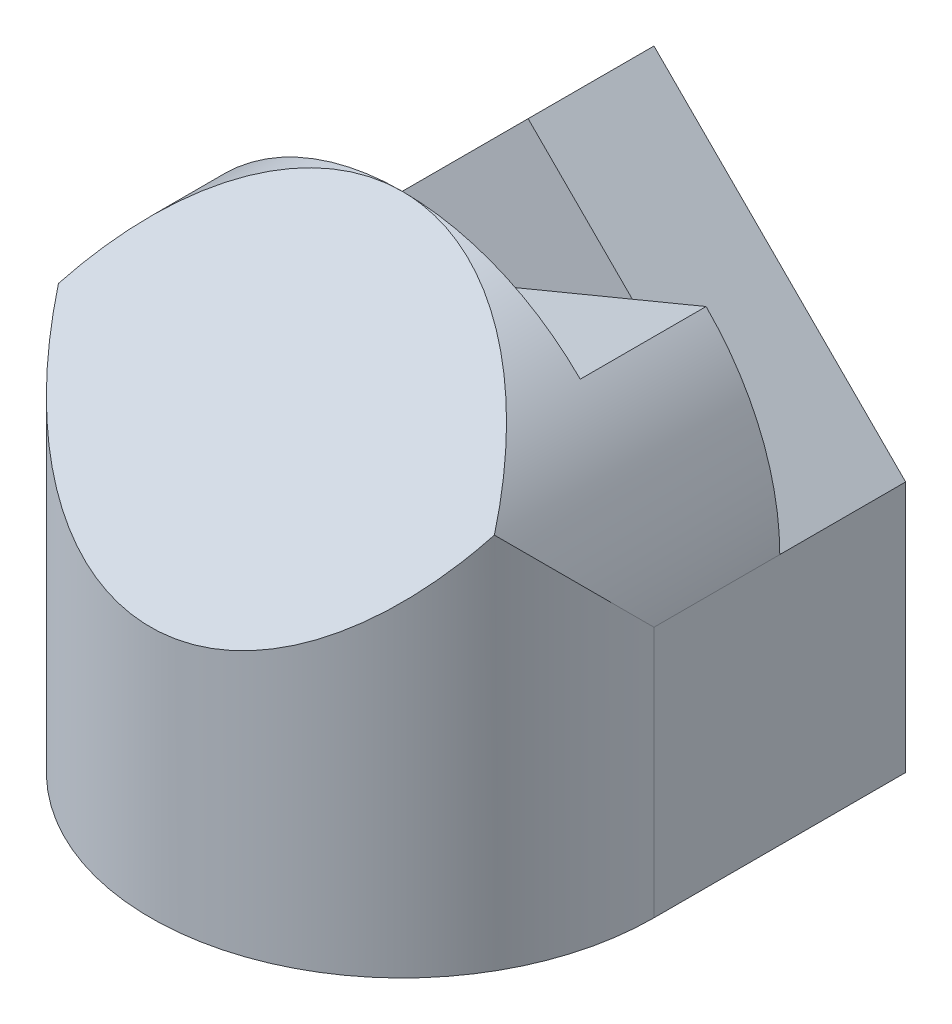
ISO-10303-21;
HEADER;
FILE_DESCRIPTION(('STEP AP214'),'2;1');
FILE_NAME('part.step','',(''),(''),'','','');
FILE_SCHEMA(('AUTOMOTIVE_DESIGN { 1 0 10303 214 1 1 1 1 }'));
ENDSEC;
DATA;
#1=APPLICATION_CONTEXT('core data for automotive mechanical design processes');
#2=APPLICATION_PROTOCOL_DEFINITION('international standard','automotive_design',2000,#1);
#3=PRODUCT_CONTEXT('',#1,'mechanical');
#4=PRODUCT('Part','Part','',(#3));
#5=PRODUCT_RELATED_PRODUCT_CATEGORY('part','',(#4));
#6=PRODUCT_DEFINITION_FORMATION('','',#4);
#7=PRODUCT_DEFINITION_CONTEXT('part definition',#1,'design');
#8=PRODUCT_DEFINITION('design','',#6,#7);
#9=PRODUCT_DEFINITION_SHAPE('','',#8);
#10=(LENGTH_UNIT() NAMED_UNIT(*) SI_UNIT(.MILLI.,.METRE.));
#11=(NAMED_UNIT(*) PLANE_ANGLE_UNIT() SI_UNIT($,.RADIAN.));
#12=(NAMED_UNIT(*) SI_UNIT($,.STERADIAN.) SOLID_ANGLE_UNIT());
#13=UNCERTAINTY_MEASURE_WITH_UNIT(LENGTH_MEASURE(1.E-05),#10,'distance_accuracy_value','');
#14=(GEOMETRIC_REPRESENTATION_CONTEXT(3) GLOBAL_UNCERTAINTY_ASSIGNED_CONTEXT((#13)) GLOBAL_UNIT_ASSIGNED_CONTEXT((#10,
#11,#12)) REPRESENTATION_CONTEXT('',''));
#15=CARTESIAN_POINT('',(0.,0.,0.));
#16=DIRECTION('',(0.,0.,1.));
#17=DIRECTION('',(1.,0.,0.));
#18=AXIS2_PLACEMENT_3D('',#15,#16,#17);
#19=CARTESIAN_POINT('',(0.,0.,20.));
#20=DIRECTION('',(0.,0.,1.));
#21=DIRECTION('',(1.,0.,0.));
#22=AXIS2_PLACEMENT_3D('',#19,#20,#21);
#23=PLANE('',#22);
#24=DIRECTION('',(0.923879532511287,0.38268343236509,0.));
#25=VECTOR('',#24,1.);
#26=CARTESIAN_POINT('',(0.,20.,20.));
#27=LINE('',#26,#25);
#28=CARTESIAN_POINT('',(0.,20.,20.));
#29=VERTEX_POINT('',#28);
#30=CARTESIAN_POINT('',(34.1421356237309,34.142135623731,20.));
#31=VERTEX_POINT('',#30);
#32=EDGE_CURVE('E146',#29,#31,#27,.T.);
#33=ORIENTED_EDGE('',*,*,#32,.F.);
#34=CARTESIAN_POINT('',(20.,20.,20.));
#35=DIRECTION('',(0.,0.,1.));
#36=DIRECTION('',(1.,0.,0.));
#37=AXIS2_PLACEMENT_3D('',#34,#35,#36);
#38=CIRCLE('',#37,20.);
#39=CARTESIAN_POINT('',(20.,40.,20.));
#40=VERTEX_POINT('',#39);
#41=EDGE_CURVE('E153',#29,#40,#38,.F.);
#42=ORIENTED_EDGE('',*,*,#41,.T.);
#43=CARTESIAN_POINT('',(20.,20.,20.));
#44=DIRECTION('',(0.,0.,1.));
#45=DIRECTION('',(1.,0.,0.));
#46=AXIS2_PLACEMENT_3D('',#43,#44,#45);
#47=CIRCLE('',#46,20.);
#48=EDGE_CURVE('E80',#31,#40,#47,.T.);
#49=ORIENTED_EDGE('',*,*,#48,.F.);
#50=EDGE_LOOP('',(#33,#42,#49));
#51=FACE_BOUND('',#50,.T.);
#52=ADVANCED_FACE('F65',(#51),#23,.F.);
#53=CARTESIAN_POINT('',(0.,0.,10.));
#54=DIRECTION('',(0.,0.,1.));
#55=DIRECTION('',(1.,0.,0.));
#56=AXIS2_PLACEMENT_3D('',#53,#54,#55);
#57=PLANE('',#56);
#58=DIRECTION('',(-0.707106781186548,-0.707106781186548,0.));
#59=VECTOR('',#58,1.);
#60=CARTESIAN_POINT('',(-10.,10.,10.));
#61=LINE('',#60,#59);
#62=CARTESIAN_POINT('',(20.,40.,10.));
#63=VERTEX_POINT('',#62);
#64=CARTESIAN_POINT('',(0.,20.,10.));
#65=VERTEX_POINT('',#64);
#66=EDGE_CURVE('E163',#63,#65,#61,.T.);
#67=ORIENTED_EDGE('',*,*,#66,.T.);
#68=DIRECTION('',(0.923879532511287,0.38268343236509,0.));
#69=VECTOR('',#68,1.);
#70=CARTESIAN_POINT('',(0.,20.,10.));
#71=LINE('',#70,#69);
#72=CARTESIAN_POINT('',(28.2842712474619,31.7157287525381,10.));
#73=VERTEX_POINT('',#72);
#74=EDGE_CURVE('E88',#65,#73,#71,.T.);
#75=ORIENTED_EDGE('',*,*,#74,.T.);
#76=DIRECTION('',(-0.707106781186548,0.707106781186548,0.));
#77=VECTOR('',#76,1.);
#78=CARTESIAN_POINT('',(30.,30.,10.));
#79=LINE('',#78,#77);
#80=EDGE_CURVE('E173',#73,#63,#79,.T.);
#81=ORIENTED_EDGE('',*,*,#80,.T.);
#82=EDGE_LOOP('',(#67,#75,#81));
#83=FACE_BOUND('',#82,.T.);
#84=ADVANCED_FACE('F228',(#83),#57,.T.);
#85=CARTESIAN_POINT('',(20.,20.,40.));
#86=DIRECTION('',(0.,0.,-1.));
#87=DIRECTION('',(-1.,0.,0.));
#88=AXIS2_PLACEMENT_3D('',#85,#86,#87);
#89=CYLINDRICAL_SURFACE('',#88,20.);
#90=CARTESIAN_POINT('',(20.,20.,20.));
#91=DIRECTION('',(0.,0.707106781186547,-0.707106781186547));
#92=DIRECTION('',(0.,-0.707106781186547,-0.707106781186547));
#93=AXIS2_PLACEMENT_3D('',#90,#91,#92);
#94=ELLIPSE('',#93,28.2842712474619,20.);
#95=CARTESIAN_POINT('',(40.,20.,20.));
#96=VERTEX_POINT('',#95);
#97=CARTESIAN_POINT('',(37.3205080756888,30.,30.));
#98=VERTEX_POINT('',#97);
#99=EDGE_CURVE('E189',#96,#98,#94,.F.);
#100=ORIENTED_EDGE('',*,*,#99,.F.);
#101=DIRECTION('',(0.,0.,-1.));
#102=VECTOR('',#101,1.);
#103=CARTESIAN_POINT('',(40.,20.,40.));
#104=LINE('',#103,#102);
#105=CARTESIAN_POINT('',(40.,20.,10.));
#106=VERTEX_POINT('',#105);
#107=EDGE_CURVE('E157',#96,#106,#104,.T.);
#108=ORIENTED_EDGE('',*,*,#107,.T.);
#109=CARTESIAN_POINT('',(20.,20.,10.));
#110=DIRECTION('',(0.,0.,-1.));
#111=DIRECTION('',(-1.,0.,0.));
#112=AXIS2_PLACEMENT_3D('',#109,#110,#111);
#113=CIRCLE('',#112,20.);
#114=CARTESIAN_POINT('',(34.1421356237309,34.142135623731,10.));
#115=VERTEX_POINT('',#114);
#116=EDGE_CURVE('E141',#115,#106,#113,.T.);
#117=ORIENTED_EDGE('',*,*,#116,.F.);
#118=DIRECTION('',(0.,0.,1.));
#119=VECTOR('',#118,1.);
#120=CARTESIAN_POINT('',(34.1421356237309,34.142135623731,10.));
#121=LINE('',#120,#119);
#122=EDGE_CURVE('E149',#115,#31,#121,.T.);
#123=ORIENTED_EDGE('',*,*,#122,.T.);
#124=ORIENTED_EDGE('',*,*,#48,.T.);
#125=CARTESIAN_POINT('',(20.,20.,40.));
#126=DIRECTION('',(0.,0.707106781186548,0.707106781186548));
#127=DIRECTION('',(0.,0.707106781186548,-0.707106781186548));
#128=AXIS2_PLACEMENT_3D('',#125,#126,#127);
#129=ELLIPSE('',#128,28.2842712474619,20.);
#130=EDGE_CURVE('E180',#98,#40,#129,.T.);
#131=ORIENTED_EDGE('',*,*,#130,.F.);
#132=EDGE_LOOP('',(#100,#108,#117,#123,#124,#131));
#133=FACE_BOUND('',#132,.T.);
#134=ADVANCED_FACE('F155',(#133),#89,.T.);
#135=CARTESIAN_POINT('',(2.67949192431123,30.,30.));
#136=VERTEX_POINT('',#135);
#137=EDGE_CURVE('E178',#40,#136,#129,.T.);
#138=ORIENTED_EDGE('',*,*,#137,.F.);
#139=ORIENTED_EDGE('',*,*,#41,.F.);
#140=EDGE_CURVE('E188',#136,#29,#94,.F.);
#141=ORIENTED_EDGE('',*,*,#140,.F.);
#142=EDGE_LOOP('',(#138,#139,#141));
#143=FACE_BOUND('',#142,.T.);
#144=ADVANCED_FACE('F67',(#143),#89,.T.);
#145=CARTESIAN_POINT('',(20.,40.,20.));
#146=DIRECTION('',(0.,-1.,0.));
#147=DIRECTION('',(0.,0.,-1.));
#148=AXIS2_PLACEMENT_3D('',#145,#146,#147);
#149=CYLINDRICAL_SURFACE('',#148,20.);
#150=CARTESIAN_POINT('',(20.,40.,20.));
#151=DIRECTION('',(0.,0.707106781186548,0.707106781186548));
#152=DIRECTION('',(0.,-0.707106781186548,0.707106781186548));
#153=AXIS2_PLACEMENT_3D('',#150,#151,#152);
#154=ELLIPSE('',#153,28.2842712474619,20.);
#155=EDGE_CURVE('E12',#98,#136,#154,.F.);
#156=ORIENTED_EDGE('',*,*,#155,.T.);
#157=ORIENTED_EDGE('',*,*,#140,.T.);
#158=DIRECTION('',(0.,-1.,0.));
#159=VECTOR('',#158,1.);
#160=CARTESIAN_POINT('',(0.,40.,20.));
#161=LINE('',#160,#159);
#162=CARTESIAN_POINT('',(0.,0.,20.));
#163=VERTEX_POINT('',#162);
#164=EDGE_CURVE('E186',#29,#163,#161,.T.);
#165=ORIENTED_EDGE('',*,*,#164,.T.);
#166=CARTESIAN_POINT('',(20.,0.,20.));
#167=DIRECTION('',(0.,1.,0.));
#168=DIRECTION('',(0.,0.,1.));
#169=AXIS2_PLACEMENT_3D('',#166,#167,#168);
#170=CIRCLE('',#169,20.);
#171=CARTESIAN_POINT('',(40.,0.,20.));
#172=VERTEX_POINT('',#171);
#173=EDGE_CURVE('E183',#172,#163,#170,.F.);
#174=ORIENTED_EDGE('',*,*,#173,.F.);
#175=DIRECTION('',(0.,-1.,0.));
#176=VECTOR('',#175,1.);
#177=CARTESIAN_POINT('',(40.,40.,20.));
#178=LINE('',#177,#176);
#179=EDGE_CURVE('E73',#96,#172,#178,.T.);
#180=ORIENTED_EDGE('',*,*,#179,.F.);
#181=ORIENTED_EDGE('',*,*,#99,.T.);
#182=EDGE_LOOP('',(#156,#157,#165,#174,#180,#181));
#183=FACE_BOUND('',#182,.T.);
#184=ADVANCED_FACE('F236',(#183),#149,.T.);
#185=CARTESIAN_POINT('',(0.,0.,40.));
#186=DIRECTION('',(0.,1.,0.));
#187=DIRECTION('',(0.,0.,1.));
#188=AXIS2_PLACEMENT_3D('',#185,#186,#187);
#189=PLANE('',#188);
#190=DIRECTION('',(0.,0.,-1.));
#191=VECTOR('',#190,1.);
#192=CARTESIAN_POINT('',(40.,0.,40.));
#193=LINE('',#192,#191);
#194=CARTESIAN_POINT('',(40.,0.,0.));
#195=VERTEX_POINT('',#194);
#196=EDGE_CURVE('E202',#172,#195,#193,.T.);
#197=ORIENTED_EDGE('',*,*,#196,.F.);
#198=ORIENTED_EDGE('',*,*,#173,.T.);
#199=DIRECTION('',(0.,0.,-1.));
#200=VECTOR('',#199,1.);
#201=CARTESIAN_POINT('',(0.,0.,40.));
#202=LINE('',#201,#200);
#203=CARTESIAN_POINT('',(0.,0.,0.));
#204=VERTEX_POINT('',#203);
#205=EDGE_CURVE('E204',#163,#204,#202,.T.);
#206=ORIENTED_EDGE('',*,*,#205,.T.);
#207=DIRECTION('',(1.,0.,0.));
#208=VECTOR('',#207,1.);
#209=CARTESIAN_POINT('',(0.,0.,0.));
#210=LINE('',#209,#208);
#211=EDGE_CURVE('E195',#204,#195,#210,.T.);
#212=ORIENTED_EDGE('',*,*,#211,.T.);
#213=EDGE_LOOP('',(#197,#198,#206,#212));
#214=FACE_BOUND('',#213,.T.);
#215=ADVANCED_FACE('F215',(#214),#189,.F.);
#216=CARTESIAN_POINT('',(0.,0.,40.));
#217=DIRECTION('',(-1.,0.,0.));
#218=DIRECTION('',(0.,0.,1.));
#219=AXIS2_PLACEMENT_3D('',#216,#217,#218);
#220=PLANE('',#219);
#221=ORIENTED_EDGE('',*,*,#164,.F.);
#222=DIRECTION('',(0.,0.,-1.));
#223=VECTOR('',#222,1.);
#224=CARTESIAN_POINT('',(0.,20.,40.));
#225=LINE('',#224,#223);
#226=EDGE_CURVE('E206',#29,#65,#225,.T.);
#227=ORIENTED_EDGE('',*,*,#226,.T.);
#228=DIRECTION('',(0.,0.,-1.));
#229=VECTOR('',#228,1.);
#230=CARTESIAN_POINT('',(0.,20.,10.));
#231=LINE('',#230,#229);
#232=CARTESIAN_POINT('',(0.,20.,0.));
#233=VERTEX_POINT('',#232);
#234=EDGE_CURVE('E164',#65,#233,#231,.T.);
#235=ORIENTED_EDGE('',*,*,#234,.T.);
#236=DIRECTION('',(0.,1.,0.));
#237=VECTOR('',#236,1.);
#238=CARTESIAN_POINT('',(0.,0.,0.));
#239=LINE('',#238,#237);
#240=EDGE_CURVE('E192',#204,#233,#239,.T.);
#241=ORIENTED_EDGE('',*,*,#240,.F.);
#242=ORIENTED_EDGE('',*,*,#205,.F.);
#243=EDGE_LOOP('',(#221,#227,#235,#241,#242));
#244=FACE_BOUND('',#243,.T.);
#245=ADVANCED_FACE('F234',(#244),#220,.T.);
#246=CARTESIAN_POINT('',(40.,0.,40.));
#247=DIRECTION('',(-1.,0.,0.));
#248=DIRECTION('',(0.,0.,1.));
#249=AXIS2_PLACEMENT_3D('',#246,#247,#248);
#250=PLANE('',#249);
#251=ORIENTED_EDGE('',*,*,#107,.F.);
#252=ORIENTED_EDGE('',*,*,#179,.T.);
#253=ORIENTED_EDGE('',*,*,#196,.T.);
#254=DIRECTION('',(0.,1.,0.));
#255=VECTOR('',#254,1.);
#256=CARTESIAN_POINT('',(40.,0.,0.));
#257=LINE('',#256,#255);
#258=CARTESIAN_POINT('',(40.,20.,0.));
#259=VERTEX_POINT('',#258);
#260=EDGE_CURVE('E198',#195,#259,#257,.T.);
#261=ORIENTED_EDGE('',*,*,#260,.T.);
#262=DIRECTION('',(0.,0.,-1.));
#263=VECTOR('',#262,1.);
#264=CARTESIAN_POINT('',(40.,20.,10.));
#265=LINE('',#264,#263);
#266=EDGE_CURVE('E172',#106,#259,#265,.T.);
#267=ORIENTED_EDGE('',*,*,#266,.F.);
#268=EDGE_LOOP('',(#251,#252,#253,#261,#267));
#269=FACE_BOUND('',#268,.T.);
#270=ADVANCED_FACE('F212',(#269),#250,.F.);
#271=CARTESIAN_POINT('',(0.,0.,0.));
#272=DIRECTION('',(0.,0.,1.));
#273=DIRECTION('',(1.,0.,0.));
#274=AXIS2_PLACEMENT_3D('',#271,#272,#273);
#275=PLANE('',#274);
#276=ORIENTED_EDGE('',*,*,#240,.T.);
#277=DIRECTION('',(-0.707106781186548,-0.707106781186548,0.));
#278=VECTOR('',#277,1.);
#279=CARTESIAN_POINT('',(-10.,10.,0.));
#280=LINE('',#279,#278);
#281=CARTESIAN_POINT('',(20.,40.,0.));
#282=VERTEX_POINT('',#281);
#283=EDGE_CURVE('E167',#282,#233,#280,.T.);
#284=ORIENTED_EDGE('',*,*,#283,.F.);
#285=DIRECTION('',(-0.707106781186548,0.707106781186548,0.));
#286=VECTOR('',#285,1.);
#287=CARTESIAN_POINT('',(30.,30.,0.));
#288=LINE('',#287,#286);
#289=EDGE_CURVE('E169',#259,#282,#288,.T.);
#290=ORIENTED_EDGE('',*,*,#289,.F.);
#291=ORIENTED_EDGE('',*,*,#260,.F.);
#292=ORIENTED_EDGE('',*,*,#211,.F.);
#293=EDGE_LOOP('',(#276,#284,#290,#291,#292));
#294=FACE_BOUND('',#293,.T.);
#295=ADVANCED_FACE('F222',(#294),#275,.F.);
#296=CARTESIAN_POINT('',(40.,20.,40.));
#297=DIRECTION('',(0.,0.707106781186548,0.707106781186548));
#298=DIRECTION('',(0.,-0.707106781186548,0.707106781186548));
#299=AXIS2_PLACEMENT_3D('',#296,#297,#298);
#300=PLANE('',#299);
#301=ORIENTED_EDGE('',*,*,#130,.T.);
#302=ORIENTED_EDGE('',*,*,#137,.T.);
#303=ORIENTED_EDGE('',*,*,#155,.F.);
#304=EDGE_LOOP('',(#301,#302,#303));
#305=FACE_BOUND('',#304,.T.);
#306=ADVANCED_FACE('F255',(#305),#300,.T.);
#307=CARTESIAN_POINT('',(30.,30.,10.));
#308=DIRECTION('',(-0.707106781186548,-0.707106781186548,0.));
#309=DIRECTION('',(0.707106781186548,-0.707106781186548,0.));
#310=AXIS2_PLACEMENT_3D('',#307,#308,#309);
#311=PLANE('',#310);
#312=ORIENTED_EDGE('',*,*,#289,.T.);
#313=DIRECTION('',(0.,0.,-1.));
#314=VECTOR('',#313,1.);
#315=CARTESIAN_POINT('',(20.,40.,10.));
#316=LINE('',#315,#314);
#317=EDGE_CURVE('E176',#63,#282,#316,.T.);
#318=ORIENTED_EDGE('',*,*,#317,.F.);
#319=ORIENTED_EDGE('',*,*,#80,.F.);
#320=EDGE_CURVE('E144',#106,#73,#79,.T.);
#321=ORIENTED_EDGE('',*,*,#320,.F.);
#322=ORIENTED_EDGE('',*,*,#266,.T.);
#323=EDGE_LOOP('',(#312,#318,#319,#321,#322));
#324=FACE_BOUND('',#323,.T.);
#325=ADVANCED_FACE('F225',(#324),#311,.F.);
#326=CARTESIAN_POINT('',(-10.,10.,10.));
#327=DIRECTION('',(0.707106781186548,-0.707106781186548,0.));
#328=DIRECTION('',(0.707106781186548,0.707106781186548,0.));
#329=AXIS2_PLACEMENT_3D('',#326,#327,#328);
#330=PLANE('',#329);
#331=ORIENTED_EDGE('',*,*,#283,.T.);
#332=ORIENTED_EDGE('',*,*,#234,.F.);
#333=ORIENTED_EDGE('',*,*,#66,.F.);
#334=ORIENTED_EDGE('',*,*,#317,.T.);
#335=EDGE_LOOP('',(#331,#332,#333,#334));
#336=FACE_BOUND('',#335,.T.);
#337=ADVANCED_FACE('F231',(#336),#330,.F.);
#338=CARTESIAN_POINT('',(20.,20.,10.));
#339=DIRECTION('',(0.,0.,-1.));
#340=DIRECTION('',(-1.,0.,0.));
#341=AXIS2_PLACEMENT_3D('',#338,#339,#340);
#342=PLANE('',#341);
#343=ORIENTED_EDGE('',*,*,#320,.T.);
#344=EDGE_CURVE('E137',#73,#115,#71,.T.);
#345=ORIENTED_EDGE('',*,*,#344,.T.);
#346=ORIENTED_EDGE('',*,*,#116,.T.);
#347=EDGE_LOOP('',(#343,#345,#346));
#348=FACE_BOUND('',#347,.T.);
#349=ADVANCED_FACE('F139',(#348),#342,.T.);
#350=CARTESIAN_POINT('',(0.,20.,10.));
#351=DIRECTION('',(0.38268343236509,-0.923879532511287,0.));
#352=DIRECTION('',(0.923879532511287,0.38268343236509,0.));
#353=AXIS2_PLACEMENT_3D('',#350,#351,#352);
#354=PLANE('',#353);
#355=ORIENTED_EDGE('',*,*,#32,.T.);
#356=ORIENTED_EDGE('',*,*,#122,.F.);
#357=ORIENTED_EDGE('',*,*,#344,.F.);
#358=ORIENTED_EDGE('',*,*,#74,.F.);
#359=ORIENTED_EDGE('',*,*,#226,.F.);
#360=EDGE_LOOP('',(#355,#356,#357,#358,#359));
#361=FACE_BOUND('',#360,.T.);
#362=ADVANCED_FACE('F150',(#361),#354,.F.);
#363=CLOSED_SHELL('',(#52,#84,#134,#144,#184,#215,#245,#270,#295,#306,#325,#337,#349,#362));
#364=MANIFOLD_SOLID_BREP('B2',#363);
#365=ADVANCED_BREP_SHAPE_REPRESENTATION('',(#18,#364),#14);
#366=SHAPE_DEFINITION_REPRESENTATION(#9,#365);
ENDSEC;
END-ISO-10303-21;
